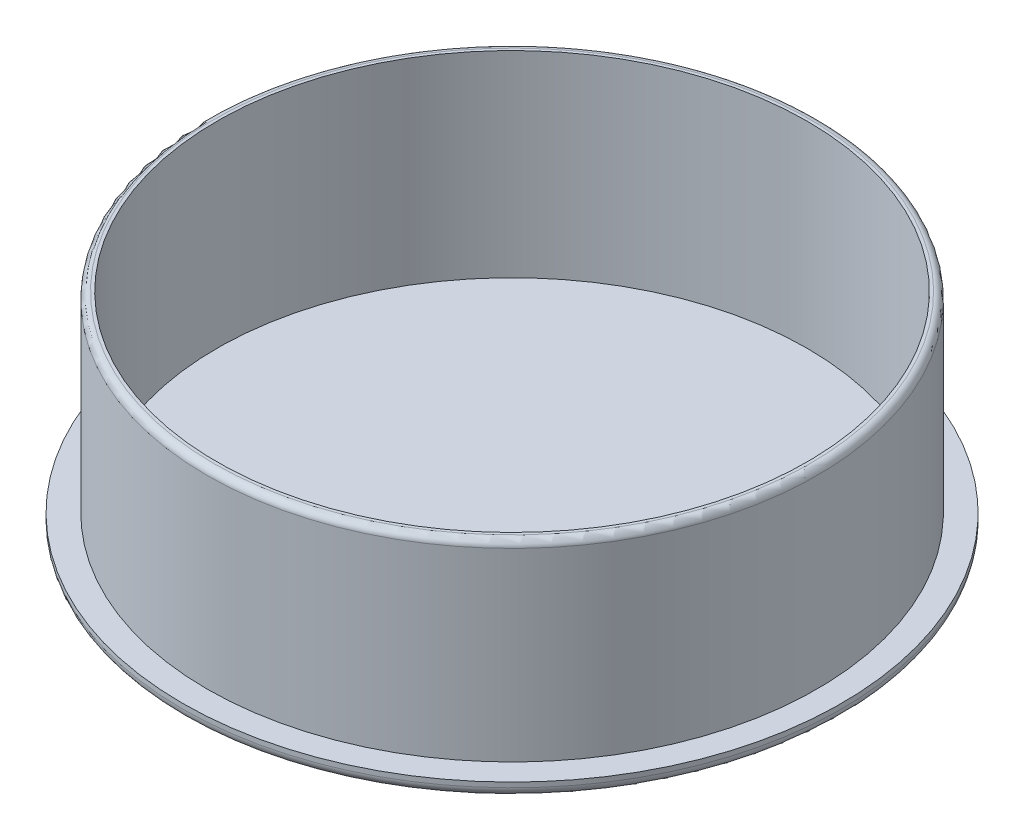
ISO-10303-21;
HEADER;
FILE_DESCRIPTION(('STEP AP214'),'2;1');
FILE_NAME('part.step','',(''),(''),'','','');
FILE_SCHEMA(('AUTOMOTIVE_DESIGN { 1 0 10303 214 1 1 1 1 }'));
ENDSEC;
DATA;
#1=APPLICATION_CONTEXT('core data for automotive mechanical design processes');
#2=APPLICATION_PROTOCOL_DEFINITION('international standard','automotive_design',2000,#1);
#3=PRODUCT_CONTEXT('',#1,'mechanical');
#4=PRODUCT('Part','Part','',(#3));
#5=PRODUCT_RELATED_PRODUCT_CATEGORY('part','',(#4));
#6=PRODUCT_DEFINITION_FORMATION('','',#4);
#7=PRODUCT_DEFINITION_CONTEXT('part definition',#1,'design');
#8=PRODUCT_DEFINITION('design','',#6,#7);
#9=PRODUCT_DEFINITION_SHAPE('','',#8);
#10=(LENGTH_UNIT() NAMED_UNIT(*) SI_UNIT(.MILLI.,.METRE.));
#11=(NAMED_UNIT(*) PLANE_ANGLE_UNIT() SI_UNIT($,.RADIAN.));
#12=(NAMED_UNIT(*) SI_UNIT($,.STERADIAN.) SOLID_ANGLE_UNIT());
#13=UNCERTAINTY_MEASURE_WITH_UNIT(LENGTH_MEASURE(1.E-05),#10,'distance_accuracy_value','');
#14=(GEOMETRIC_REPRESENTATION_CONTEXT(3) GLOBAL_UNCERTAINTY_ASSIGNED_CONTEXT((#13)) GLOBAL_UNIT_ASSIGNED_CONTEXT((#10,
#11,#12)) REPRESENTATION_CONTEXT('',''));
#15=CARTESIAN_POINT('',(0.,0.,0.));
#16=DIRECTION('',(0.,0.,1.));
#17=DIRECTION('',(1.,0.,0.));
#18=AXIS2_PLACEMENT_3D('',#15,#16,#17);
#19=CARTESIAN_POINT('',(0.,42.,0.));
#20=DIRECTION('',(0.,-1.,0.));
#21=DIRECTION('',(0.,0.,-1.));
#22=AXIS2_PLACEMENT_3D('',#19,#20,#21);
#23=CYLINDRICAL_SURFACE('',#22,62.);
#24=CARTESIAN_POINT('',(0.,40.6,0.));
#25=DIRECTION('',(0.,1.,0.));
#26=DIRECTION('',(0.,0.,1.));
#27=AXIS2_PLACEMENT_3D('',#24,#25,#26);
#28=CIRCLE('',#27,62.);
#29=CARTESIAN_POINT('',(0.,40.6,-62.));
#30=VERTEX_POINT('',#29);
#31=EDGE_CURVE('E10',#30,#30,#28,.F.);
#32=CARTESIAN_POINT('',(0.,3.,0.));
#33=DIRECTION('',(0.,1.,0.));
#34=DIRECTION('',(0.,0.,1.));
#35=AXIS2_PLACEMENT_3D('',#32,#33,#34);
#36=CIRCLE('',#35,62.);
#37=CARTESIAN_POINT('',(0.,3.,-62.));
#38=VERTEX_POINT('',#37);
#39=EDGE_CURVE('E50',#38,#38,#36,.T.);
#40=CARTESIAN_POINT('',(0.,40.6,-62.));
#41=CARTESIAN_POINT('',(0.,40.2083333333333,-62.));
#42=CARTESIAN_POINT('',(0.,39.8166666666667,-62.));
#43=CARTESIAN_POINT('',(0.,39.0333333333333,-62.));
#44=CARTESIAN_POINT('',(0.,38.6416666666667,-62.));
#45=CARTESIAN_POINT('',(0.,37.8583333333333,-62.));
#46=CARTESIAN_POINT('',(0.,37.4666666666667,-62.));
#47=CARTESIAN_POINT('',(0.,36.6833333333333,-62.));
#48=CARTESIAN_POINT('',(0.,36.2916666666667,-62.));
#49=CARTESIAN_POINT('',(0.,35.5083333333333,-62.));
#50=CARTESIAN_POINT('',(0.,35.1166666666667,-62.));
#51=CARTESIAN_POINT('',(0.,34.3333333333333,-62.));
#52=CARTESIAN_POINT('',(0.,33.9416666666667,-62.));
#53=CARTESIAN_POINT('',(0.,33.1583333333333,-62.));
#54=CARTESIAN_POINT('',(0.,32.7666666666667,-62.));
#55=CARTESIAN_POINT('',(0.,31.9833333333333,-62.));
#56=CARTESIAN_POINT('',(0.,31.5916666666667,-62.));
#57=CARTESIAN_POINT('',(0.,30.8083333333333,-62.));
#58=CARTESIAN_POINT('',(0.,30.4166666666667,-62.));
#59=CARTESIAN_POINT('',(0.,29.6333333333333,-62.));
#60=CARTESIAN_POINT('',(0.,29.2416666666667,-62.));
#61=CARTESIAN_POINT('',(0.,28.4583333333333,-62.));
#62=CARTESIAN_POINT('',(0.,28.0666666666667,-62.));
#63=CARTESIAN_POINT('',(0.,27.2833333333333,-62.));
#64=CARTESIAN_POINT('',(0.,26.8916666666667,-62.));
#65=CARTESIAN_POINT('',(0.,26.1083333333333,-62.));
#66=CARTESIAN_POINT('',(0.,25.7166666666667,-62.));
#67=CARTESIAN_POINT('',(0.,24.9333333333333,-62.));
#68=CARTESIAN_POINT('',(0.,24.5416666666667,-62.));
#69=CARTESIAN_POINT('',(0.,23.7583333333333,-62.));
#70=CARTESIAN_POINT('',(0.,23.3666666666667,-62.));
#71=CARTESIAN_POINT('',(0.,22.5833333333333,-62.));
#72=CARTESIAN_POINT('',(0.,22.1916666666667,-62.));
#73=CARTESIAN_POINT('',(0.,21.4083333333333,-62.));
#74=CARTESIAN_POINT('',(0.,21.0166666666667,-62.));
#75=CARTESIAN_POINT('',(0.,20.2333333333333,-62.));
#76=CARTESIAN_POINT('',(0.,19.8416666666667,-62.));
#77=CARTESIAN_POINT('',(0.,19.0583333333333,-62.));
#78=CARTESIAN_POINT('',(0.,18.6666666666667,-62.));
#79=CARTESIAN_POINT('',(0.,17.8833333333333,-62.));
#80=CARTESIAN_POINT('',(0.,17.4916666666667,-62.));
#81=CARTESIAN_POINT('',(0.,16.7083333333333,-62.));
#82=CARTESIAN_POINT('',(0.,16.3166666666667,-62.));
#83=CARTESIAN_POINT('',(0.,15.5333333333333,-62.));
#84=CARTESIAN_POINT('',(0.,15.1416666666667,-62.));
#85=CARTESIAN_POINT('',(0.,14.3583333333333,-62.));
#86=CARTESIAN_POINT('',(0.,13.9666666666667,-62.));
#87=CARTESIAN_POINT('',(0.,13.1833333333333,-62.));
#88=CARTESIAN_POINT('',(0.,12.7916666666667,-62.));
#89=CARTESIAN_POINT('',(0.,12.0083333333333,-62.));
#90=CARTESIAN_POINT('',(0.,11.6166666666667,-62.));
#91=CARTESIAN_POINT('',(0.,10.8333333333333,-62.));
#92=CARTESIAN_POINT('',(0.,10.4416666666667,-62.));
#93=CARTESIAN_POINT('',(0.,9.65833333333333,-62.));
#94=CARTESIAN_POINT('',(0.,9.26666666666666,-62.));
#95=CARTESIAN_POINT('',(0.,8.48333333333333,-62.));
#96=CARTESIAN_POINT('',(0.,8.09166666666666,-62.));
#97=CARTESIAN_POINT('',(0.,7.30833333333333,-62.));
#98=CARTESIAN_POINT('',(0.,6.91666666666667,-62.));
#99=CARTESIAN_POINT('',(0.,6.13333333333333,-62.));
#100=CARTESIAN_POINT('',(0.,5.74166666666666,-62.));
#101=CARTESIAN_POINT('',(0.,4.95833333333333,-62.));
#102=CARTESIAN_POINT('',(0.,4.56666666666666,-62.));
#103=CARTESIAN_POINT('',(0.,3.78333333333333,-62.));
#104=CARTESIAN_POINT('',(0.,3.39166666666667,-62.));
#105=CARTESIAN_POINT('',(0.,3.,-62.));
#106=B_SPLINE_CURVE_WITH_KNOTS('',3,(#40,#41,#42,#43,#44,#45,#46,#47,#48,#49,#50,#51,#52,#53,
#54,#55,#56,#57,#58,#59,#60,#61,#62,#63,#64,#65,#66,#67,#68,#69,#70,#71,#72,#73,#74,#75,#76,#77,
#78,#79,#80,#81,#82,#83,#84,#85,#86,#87,#88,#89,#90,#91,#92,#93,#94,#95,#96,#97,#98,#99,#100,
#101,#102,#103,#104,#105),.UNSPECIFIED.,.F.,.F.,(4,2,2,2,2,2,2,2,2,2,2,2,2,2,2,2,2,2,2,2,2,2,2,
2,2,2,2,2,2,2,2,2,4),(0.,1.175,2.35,3.525,4.7,5.87500000000001,7.05,8.225,9.40000000000001,
10.575,11.75,12.925,14.1,15.275,16.45,17.625,18.8,19.975,21.15,22.325,23.5,24.675,25.85,27.025,
28.2,29.375,30.55,31.725,32.9,34.075,35.25,36.425,37.6),.UNSPECIFIED.);
#107=EDGE_CURVE('BSEAM30',#30,#38,#106,.T.);
#108=ORIENTED_EDGE('',*,*,#31,.T.);
#109=ORIENTED_EDGE('',*,*,#39,.T.);
#110=ORIENTED_EDGE('',*,*,#107,.T.);
#111=ORIENTED_EDGE('',*,*,#107,.F.);
#112=EDGE_LOOP('',(#108,#110,#109,#111));
#113=FACE_BOUND('',#112,.T.);
#114=ADVANCED_FACE('F30',(#113),#23,.T.);
#115=CARTESIAN_POINT('',(0.,42.,0.));
#116=DIRECTION('',(0.,1.,0.));
#117=DIRECTION('',(0.,0.,1.));
#118=AXIS2_PLACEMENT_3D('',#115,#116,#117);
#119=PLANE('',#118);
#120=CARTESIAN_POINT('',(0.,42.,0.));
#121=DIRECTION('',(0.,1.,0.));
#122=DIRECTION('',(0.,0.,1.));
#123=AXIS2_PLACEMENT_3D('',#120,#121,#122);
#124=CIRCLE('',#123,60.6);
#125=CARTESIAN_POINT('',(0.,42.,60.6));
#126=VERTEX_POINT('',#125);
#127=EDGE_CURVE('E37',#126,#126,#124,.T.);
#128=ORIENTED_EDGE('',*,*,#127,.T.);
#129=EDGE_LOOP('',(#128));
#130=FACE_BOUND('',#129,.T.);
#131=CARTESIAN_POINT('',(0.,42.,0.));
#132=DIRECTION('',(0.,1.,0.));
#133=DIRECTION('',(0.,0.,1.));
#134=AXIS2_PLACEMENT_3D('',#131,#132,#133);
#135=CIRCLE('',#134,60.);
#136=CARTESIAN_POINT('',(0.,42.,-60.));
#137=VERTEX_POINT('',#136);
#138=EDGE_CURVE('E59',#137,#137,#135,.T.);
#139=ORIENTED_EDGE('',*,*,#138,.F.);
#140=EDGE_LOOP('',(#139));
#141=FACE_BOUND('',#140,.T.);
#142=ADVANCED_FACE('F65',(#130,#141),#119,.T.);
#143=CARTESIAN_POINT('',(0.,3.,0.));
#144=DIRECTION('',(0.,-1.,0.));
#145=DIRECTION('',(0.,0.,-1.));
#146=AXIS2_PLACEMENT_3D('',#143,#144,#145);
#147=CYLINDRICAL_SURFACE('',#146,67.);
#148=CARTESIAN_POINT('',(0.,2.,0.));
#149=DIRECTION('',(0.,1.,0.));
#150=DIRECTION('',(0.,0.,1.));
#151=AXIS2_PLACEMENT_3D('',#148,#149,#150);
#152=CIRCLE('',#151,67.);
#153=CARTESIAN_POINT('',(0.,2.,67.));
#154=VERTEX_POINT('',#153);
#155=EDGE_CURVE('E45',#154,#154,#152,.T.);
#156=ORIENTED_EDGE('',*,*,#155,.T.);
#157=EDGE_LOOP('',(#156));
#158=FACE_BOUND('',#157,.T.);
#159=CARTESIAN_POINT('',(0.,3.,0.));
#160=DIRECTION('',(0.,1.,0.));
#161=DIRECTION('',(0.,0.,1.));
#162=AXIS2_PLACEMENT_3D('',#159,#160,#161);
#163=CIRCLE('',#162,67.);
#164=CARTESIAN_POINT('',(0.,3.,67.));
#165=VERTEX_POINT('',#164);
#166=EDGE_CURVE('E53',#165,#165,#163,.T.);
#167=ORIENTED_EDGE('',*,*,#166,.F.);
#168=EDGE_LOOP('',(#167));
#169=FACE_BOUND('',#168,.T.);
#170=ADVANCED_FACE('F67',(#158,#169),#147,.T.);
#171=CARTESIAN_POINT('',(0.,3.,0.));
#172=DIRECTION('',(0.,1.,0.));
#173=DIRECTION('',(0.,0.,1.));
#174=AXIS2_PLACEMENT_3D('',#171,#172,#173);
#175=PLANE('',#174);
#176=ORIENTED_EDGE('',*,*,#39,.F.);
#177=EDGE_LOOP('',(#176));
#178=FACE_BOUND('',#177,.T.);
#179=ORIENTED_EDGE('',*,*,#166,.T.);
#180=EDGE_LOOP('',(#179));
#181=FACE_BOUND('',#180,.T.);
#182=ADVANCED_FACE('F73',(#178,#181),#175,.T.);
#183=CARTESIAN_POINT('',(0.,0.,0.));
#184=DIRECTION('',(0.,1.,0.));
#185=DIRECTION('',(0.,0.,1.));
#186=AXIS2_PLACEMENT_3D('',#183,#184,#185);
#187=PLANE('',#186);
#188=CARTESIAN_POINT('',(0.,0.,0.));
#189=DIRECTION('',(0.,1.,0.));
#190=DIRECTION('',(0.,0.,1.));
#191=AXIS2_PLACEMENT_3D('',#188,#189,#190);
#192=CIRCLE('',#191,65.);
#193=CARTESIAN_POINT('',(0.,0.,65.));
#194=VERTEX_POINT('',#193);
#195=EDGE_CURVE('E41',#194,#194,#192,.F.);
#196=ORIENTED_EDGE('',*,*,#195,.T.);
#197=EDGE_LOOP('',(#196));
#198=FACE_BOUND('',#197,.T.);
#199=ADVANCED_FACE('F79',(#198),#187,.F.);
#200=CARTESIAN_POINT('',(0.,2.,0.));
#201=DIRECTION('',(0.,1.,0.));
#202=DIRECTION('',(0.,0.,1.));
#203=AXIS2_PLACEMENT_3D('',#200,#201,#202);
#204=TOROIDAL_SURFACE('',#203,65.,2.);
#205=ORIENTED_EDGE('',*,*,#195,.F.);
#206=EDGE_LOOP('',(#205));
#207=FACE_BOUND('',#206,.T.);
#208=ORIENTED_EDGE('',*,*,#155,.F.);
#209=EDGE_LOOP('',(#208));
#210=FACE_BOUND('',#209,.T.);
#211=ADVANCED_FACE('F81',(#207,#210),#204,.T.);
#212=CARTESIAN_POINT('',(0.,2.,0.));
#213=DIRECTION('',(0.,1.,0.));
#214=DIRECTION('',(0.,0.,1.));
#215=AXIS2_PLACEMENT_3D('',#212,#213,#214);
#216=PLANE('',#215);
#217=CARTESIAN_POINT('',(0.,2.,0.));
#218=DIRECTION('',(0.,1.,0.));
#219=DIRECTION('',(0.,0.,1.));
#220=AXIS2_PLACEMENT_3D('',#217,#218,#219);
#221=CIRCLE('',#220,60.);
#222=CARTESIAN_POINT('',(0.,2.,-60.));
#223=VERTEX_POINT('',#222);
#224=EDGE_CURVE('E56',#223,#223,#221,.F.);
#225=ORIENTED_EDGE('',*,*,#224,.F.);
#226=EDGE_LOOP('',(#225));
#227=FACE_BOUND('',#226,.T.);
#228=ADVANCED_FACE('F84',(#227),#216,.T.);
#229=CARTESIAN_POINT('',(0.,42.,0.));
#230=DIRECTION('',(0.,-1.,0.));
#231=DIRECTION('',(0.,0.,-1.));
#232=AXIS2_PLACEMENT_3D('',#229,#230,#231);
#233=CYLINDRICAL_SURFACE('',#232,60.);
#234=CARTESIAN_POINT('',(0.,2.,-60.));
#235=CARTESIAN_POINT('',(0.,2.41666666666667,-60.));
#236=CARTESIAN_POINT('',(0.,2.83333333333334,-60.));
#237=CARTESIAN_POINT('',(0.,3.66666666666667,-60.));
#238=CARTESIAN_POINT('',(0.,4.08333333333334,-60.));
#239=CARTESIAN_POINT('',(0.,4.91666666666667,-60.));
#240=CARTESIAN_POINT('',(0.,5.33333333333334,-60.));
#241=CARTESIAN_POINT('',(0.,6.16666666666667,-60.));
#242=CARTESIAN_POINT('',(0.,6.58333333333333,-60.));
#243=CARTESIAN_POINT('',(0.,7.41666666666667,-60.));
#244=CARTESIAN_POINT('',(0.,7.83333333333333,-60.));
#245=CARTESIAN_POINT('',(0.,8.66666666666667,-60.));
#246=CARTESIAN_POINT('',(0.,9.08333333333333,-60.));
#247=CARTESIAN_POINT('',(0.,9.91666666666667,-60.));
#248=CARTESIAN_POINT('',(0.,10.3333333333333,-60.));
#249=CARTESIAN_POINT('',(0.,11.1666666666667,-60.));
#250=CARTESIAN_POINT('',(0.,11.5833333333333,-60.));
#251=CARTESIAN_POINT('',(0.,12.4166666666667,-60.));
#252=CARTESIAN_POINT('',(0.,12.8333333333333,-60.));
#253=CARTESIAN_POINT('',(0.,13.6666666666667,-60.));
#254=CARTESIAN_POINT('',(0.,14.0833333333333,-60.));
#255=CARTESIAN_POINT('',(0.,14.9166666666667,-60.));
#256=CARTESIAN_POINT('',(0.,15.3333333333333,-60.));
#257=CARTESIAN_POINT('',(0.,16.1666666666667,-60.));
#258=CARTESIAN_POINT('',(0.,16.5833333333333,-60.));
#259=CARTESIAN_POINT('',(0.,17.4166666666667,-60.));
#260=CARTESIAN_POINT('',(0.,17.8333333333333,-60.));
#261=CARTESIAN_POINT('',(0.,18.6666666666667,-60.));
#262=CARTESIAN_POINT('',(0.,19.0833333333333,-60.));
#263=CARTESIAN_POINT('',(0.,19.9166666666667,-60.));
#264=CARTESIAN_POINT('',(0.,20.3333333333333,-60.));
#265=CARTESIAN_POINT('',(0.,21.1666666666667,-60.));
#266=CARTESIAN_POINT('',(0.,21.5833333333333,-60.));
#267=CARTESIAN_POINT('',(0.,22.4166666666667,-60.));
#268=CARTESIAN_POINT('',(0.,22.8333333333333,-60.));
#269=CARTESIAN_POINT('',(0.,23.6666666666667,-60.));
#270=CARTESIAN_POINT('',(0.,24.0833333333333,-60.));
#271=CARTESIAN_POINT('',(0.,24.9166666666667,-60.));
#272=CARTESIAN_POINT('',(0.,25.3333333333333,-60.));
#273=CARTESIAN_POINT('',(0.,26.1666666666667,-60.));
#274=CARTESIAN_POINT('',(0.,26.5833333333333,-60.));
#275=CARTESIAN_POINT('',(0.,27.4166666666667,-60.));
#276=CARTESIAN_POINT('',(0.,27.8333333333333,-60.));
#277=CARTESIAN_POINT('',(0.,28.6666666666667,-60.));
#278=CARTESIAN_POINT('',(0.,29.0833333333333,-60.));
#279=CARTESIAN_POINT('',(0.,29.9166666666667,-60.));
#280=CARTESIAN_POINT('',(0.,30.3333333333333,-60.));
#281=CARTESIAN_POINT('',(0.,31.1666666666667,-60.));
#282=CARTESIAN_POINT('',(0.,31.5833333333333,-60.));
#283=CARTESIAN_POINT('',(0.,32.4166666666667,-60.));
#284=CARTESIAN_POINT('',(0.,32.8333333333333,-60.));
#285=CARTESIAN_POINT('',(0.,33.6666666666667,-60.));
#286=CARTESIAN_POINT('',(0.,34.0833333333333,-60.));
#287=CARTESIAN_POINT('',(0.,34.9166666666667,-60.));
#288=CARTESIAN_POINT('',(0.,35.3333333333333,-60.));
#289=CARTESIAN_POINT('',(0.,36.1666666666667,-60.));
#290=CARTESIAN_POINT('',(0.,36.5833333333333,-60.));
#291=CARTESIAN_POINT('',(0.,37.4166666666667,-60.));
#292=CARTESIAN_POINT('',(0.,37.8333333333333,-60.));
#293=CARTESIAN_POINT('',(0.,38.6666666666667,-60.));
#294=CARTESIAN_POINT('',(0.,39.0833333333333,-60.));
#295=CARTESIAN_POINT('',(0.,39.9166666666667,-60.));
#296=CARTESIAN_POINT('',(0.,40.3333333333333,-60.));
#297=CARTESIAN_POINT('',(0.,41.1666666666667,-60.));
#298=CARTESIAN_POINT('',(0.,41.5833333333333,-60.));
#299=CARTESIAN_POINT('',(0.,42.,-60.));
#300=B_SPLINE_CURVE_WITH_KNOTS('',3,(#234,#235,#236,#237,#238,#239,#240,#241,#242,#243,#244,
#245,#246,#247,#248,#249,#250,#251,#252,#253,#254,#255,#256,#257,#258,#259,#260,#261,#262,#263,
#264,#265,#266,#267,#268,#269,#270,#271,#272,#273,#274,#275,#276,#277,#278,#279,#280,#281,#282,
#283,#284,#285,#286,#287,#288,#289,#290,#291,#292,#293,#294,#295,#296,#297,#298,#299),
.UNSPECIFIED.,.F.,.F.,(4,2,2,2,2,2,2,2,2,2,2,2,2,2,2,2,2,2,2,2,2,2,2,2,2,2,2,2,2,2,2,2,4),(0.,
1.25,2.5,3.75,5.,6.25,7.5,8.75,10.,11.25,12.5,13.75,15.,16.25,17.5,18.75,20.,21.25,22.5,23.75,
25.,26.25,27.5,28.75,30.,31.25,32.5,33.75,35.,36.25,37.5,38.75,40.),.UNSPECIFIED.);
#301=EDGE_CURVE('BSEAM63',#223,#137,#300,.T.);
#302=ORIENTED_EDGE('',*,*,#224,.T.);
#303=ORIENTED_EDGE('',*,*,#138,.T.);
#304=ORIENTED_EDGE('',*,*,#301,.T.);
#305=ORIENTED_EDGE('',*,*,#301,.F.);
#306=EDGE_LOOP('',(#302,#304,#303,#305));
#307=FACE_BOUND('',#306,.T.);
#308=ADVANCED_FACE('F63',(#307),#233,.F.);
#309=CARTESIAN_POINT('',(0.,40.6,0.));
#310=DIRECTION('',(0.,1.,0.));
#311=DIRECTION('',(0.,0.,1.));
#312=AXIS2_PLACEMENT_3D('',#309,#310,#311);
#313=TOROIDAL_SURFACE('',#312,60.6,1.4);
#314=ORIENTED_EDGE('',*,*,#31,.F.);
#315=EDGE_LOOP('',(#314));
#316=FACE_BOUND('',#315,.T.);
#317=ORIENTED_EDGE('',*,*,#127,.F.);
#318=EDGE_LOOP('',(#317));
#319=FACE_BOUND('',#318,.T.);
#320=ADVANCED_FACE('F32',(#316,#319),#313,.T.);
#321=CLOSED_SHELL('',(#114,#142,#170,#182,#199,#211,#228,#308,#320));
#322=MANIFOLD_SOLID_BREP('B2',#321);
#323=ADVANCED_BREP_SHAPE_REPRESENTATION('',(#18,#322),#14);
#324=SHAPE_DEFINITION_REPRESENTATION(#9,#323);
ENDSEC;
END-ISO-10303-21;
